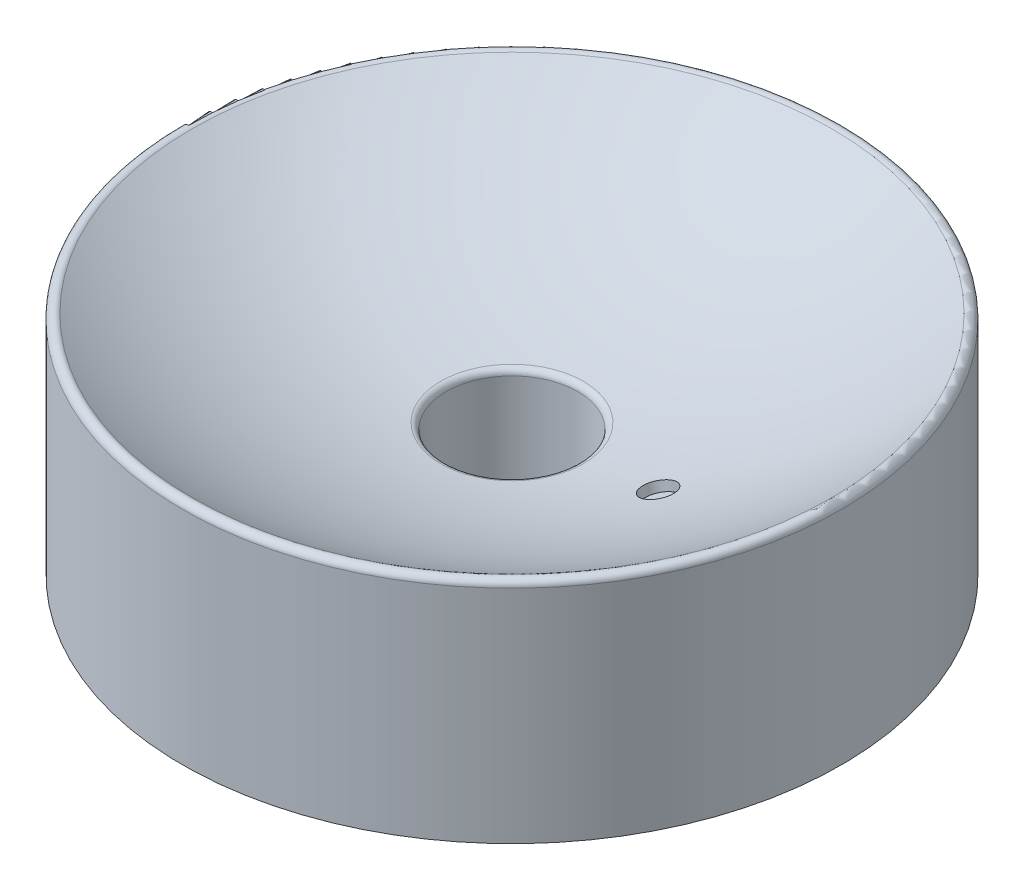
ISO-10303-21;
HEADER;
FILE_DESCRIPTION(('STEP AP214'),'2;1');
FILE_NAME('part.step','',(''),(''),'','','');
FILE_SCHEMA(('AUTOMOTIVE_DESIGN { 1 0 10303 214 1 1 1 1 }'));
ENDSEC;
DATA;
#1=APPLICATION_CONTEXT('core data for automotive mechanical design processes');
#2=APPLICATION_PROTOCOL_DEFINITION('international standard','automotive_design',2000,#1);
#3=PRODUCT_CONTEXT('',#1,'mechanical');
#4=PRODUCT('Part','Part','',(#3));
#5=PRODUCT_RELATED_PRODUCT_CATEGORY('part','',(#4));
#6=PRODUCT_DEFINITION_FORMATION('','',#4);
#7=PRODUCT_DEFINITION_CONTEXT('part definition',#1,'design');
#8=PRODUCT_DEFINITION('design','',#6,#7);
#9=PRODUCT_DEFINITION_SHAPE('','',#8);
#10=(LENGTH_UNIT() NAMED_UNIT(*) SI_UNIT(.MILLI.,.METRE.));
#11=(NAMED_UNIT(*) PLANE_ANGLE_UNIT() SI_UNIT($,.RADIAN.));
#12=(NAMED_UNIT(*) SI_UNIT($,.STERADIAN.) SOLID_ANGLE_UNIT());
#13=UNCERTAINTY_MEASURE_WITH_UNIT(LENGTH_MEASURE(1.E-05),#10,'distance_accuracy_value','');
#14=(GEOMETRIC_REPRESENTATION_CONTEXT(3) GLOBAL_UNCERTAINTY_ASSIGNED_CONTEXT((#13)) GLOBAL_UNIT_ASSIGNED_CONTEXT((#10,
#11,#12)) REPRESENTATION_CONTEXT('',''));
#15=CARTESIAN_POINT('',(0.,0.,0.));
#16=DIRECTION('',(0.,0.,1.));
#17=DIRECTION('',(1.,0.,0.));
#18=AXIS2_PLACEMENT_3D('',#15,#16,#17);
#19=CARTESIAN_POINT('',(21.,0.,0.));
#20=DIRECTION('',(0.,-1.,0.));
#21=DIRECTION('',(0.,0.,-1.));
#22=AXIS2_PLACEMENT_3D('',#19,#20,#21);
#23=PLANE('',#22);
#24=CARTESIAN_POINT('',(0.,0.,0.));
#25=DIRECTION('',(0.,-1.,0.));
#26=DIRECTION('',(0.,0.,-1.));
#27=AXIS2_PLACEMENT_3D('',#24,#25,#26);
#28=CIRCLE('',#27,22.5);
#29=CARTESIAN_POINT('',(0.,0.,-22.5));
#30=VERTEX_POINT('',#29);
#31=EDGE_CURVE('E83',#30,#30,#28,.T.);
#32=ORIENTED_EDGE('',*,*,#31,.T.);
#33=EDGE_LOOP('',(#32));
#34=FACE_BOUND('',#33,.T.);
#35=CARTESIAN_POINT('',(0.,0.,0.));
#36=DIRECTION('',(0.,-1.,0.));
#37=DIRECTION('',(0.,0.,-1.));
#38=AXIS2_PLACEMENT_3D('',#35,#36,#37);
#39=CIRCLE('',#38,21.);
#40=CARTESIAN_POINT('',(0.,0.,-21.));
#41=VERTEX_POINT('',#40);
#42=EDGE_CURVE('E10',#41,#41,#39,.T.);
#43=ORIENTED_EDGE('',*,*,#42,.F.);
#44=EDGE_LOOP('',(#43));
#45=FACE_BOUND('',#44,.T.);
#46=ADVANCED_FACE('F37',(#34,#45),#23,.T.);
#47=CARTESIAN_POINT('',(0.,0.,0.));
#48=DIRECTION('',(0.,-1.,0.));
#49=DIRECTION('',(0.,0.,-1.));
#50=AXIS2_PLACEMENT_3D('',#47,#48,#49);
#51=CYLINDRICAL_SURFACE('',#50,21.);
#52=ORIENTED_EDGE('',*,*,#42,.T.);
#53=EDGE_LOOP('',(#52));
#54=FACE_BOUND('',#53,.T.);
#55=CARTESIAN_POINT('',(0.,40.,0.));
#56=DIRECTION('',(0.,-1.,0.));
#57=DIRECTION('',(0.,0.,-1.));
#58=AXIS2_PLACEMENT_3D('',#55,#56,#57);
#59=CIRCLE('',#58,21.);
#60=CARTESIAN_POINT('',(0.,40.,-21.));
#61=VERTEX_POINT('',#60);
#62=EDGE_CURVE('E44',#61,#61,#59,.T.);
#63=ORIENTED_EDGE('',*,*,#62,.F.);
#64=EDGE_LOOP('',(#63));
#65=FACE_BOUND('',#64,.T.);
#66=ADVANCED_FACE('F170',(#54,#65),#51,.F.);
#67=CARTESIAN_POINT('',(0.,40.,0.));
#68=DIRECTION('',(0.,-1.,0.));
#69=DIRECTION('',(0.,0.,-1.));
#70=AXIS2_PLACEMENT_3D('',#67,#68,#69);
#71=TOROIDAL_SURFACE('',#70,23.,2.00000000000001);
#72=ORIENTED_EDGE('',*,*,#62,.T.);
#73=EDGE_LOOP('',(#72));
#74=FACE_BOUND('',#73,.T.);
#75=CARTESIAN_POINT('',(0.,41.983965429696,0.));
#76=DIRECTION('',(0.,-1.,0.));
#77=DIRECTION('',(0.,0.,-1.));
#78=AXIS2_PLACEMENT_3D('',#75,#76,#77);
#79=CIRCLE('',#78,22.7472527472527);
#80=CARTESIAN_POINT('',(0.,41.983965429696,-22.7472527472527));
#81=VERTEX_POINT('',#80);
#82=EDGE_CURVE('E48',#81,#81,#79,.T.);
#83=ORIENTED_EDGE('',*,*,#82,.F.);
#84=EDGE_LOOP('',(#83));
#85=FACE_BOUND('',#84,.T.);
#86=ADVANCED_FACE('F115',(#74,#85),#71,.T.);
#87=CARTESIAN_POINT('',(0.,220.540854102333,0.));
#88=DIRECTION('',(0.,-1.,0.));
#89=DIRECTION('',(1.,0.,0.));
#90=AXIS2_PLACEMENT_3D('',#87,#88,#89);
#91=SPHERICAL_SURFACE('',#90,180.);
#92=CARTESIAN_POINT('',(46.5694511051966,46.7412964971406,0.));
#93=DIRECTION('',(-0.258819045102515,0.96592582628907,0.));
#94=DIRECTION('',(-0.96592582628907,-0.258819045102515,0.));
#95=AXIS2_PLACEMENT_3D('',#92,#93,#94);
#96=CIRCLE('',#95,4.99999999999999);
#97=CARTESIAN_POINT('',(41.7398219737512,45.447201271628,0.));
#98=VERTEX_POINT('',#97);
#99=EDGE_CURVE('E86',#98,#98,#96,.T.);
#100=ORIENTED_EDGE('',*,*,#99,.F.);
#101=EDGE_LOOP('',(#100));
#102=FACE_BOUND('',#101,.T.);
#103=ORIENTED_EDGE('',*,*,#82,.T.);
#104=EDGE_LOOP('',(#103));
#105=FACE_BOUND('',#104,.T.);
#106=CARTESIAN_POINT('',(0.,72.1397634402465,0.));
#107=DIRECTION('',(0.,-1.,0.));
#108=DIRECTION('',(0.,0.,-1.));
#109=AXIS2_PLACEMENT_3D('',#106,#107,#108);
#110=CIRCLE('',#109,101.868131868132);
#111=CARTESIAN_POINT('',(0.,72.1397634402465,-101.868131868132));
#112=VERTEX_POINT('',#111);
#113=EDGE_CURVE('E54',#112,#112,#110,.T.);
#114=ORIENTED_EDGE('',*,*,#113,.F.);
#115=EDGE_LOOP('',(#114));
#116=FACE_BOUND('',#115,.T.);
#117=ADVANCED_FACE('F111',(#102,#105,#116),#91,.F.);
#118=CARTESIAN_POINT('',(0.,70.4908624328901,0.));
#119=DIRECTION('',(0.,-1.,0.));
#120=DIRECTION('',(0.,0.,-1.));
#121=AXIS2_PLACEMENT_3D('',#118,#119,#120);
#122=TOROIDAL_SURFACE('',#121,103.,1.99999999999999);
#123=ORIENTED_EDGE('',*,*,#113,.T.);
#124=EDGE_LOOP('',(#123));
#125=FACE_BOUND('',#124,.T.);
#126=CARTESIAN_POINT('',(0.,70.4908624328901,0.));
#127=DIRECTION('',(0.,-1.,0.));
#128=DIRECTION('',(0.,0.,-1.));
#129=AXIS2_PLACEMENT_3D('',#126,#127,#128);
#130=CIRCLE('',#129,105.);
#131=CARTESIAN_POINT('',(0.,70.4908624328901,-105.));
#132=VERTEX_POINT('',#131);
#133=EDGE_CURVE('E57',#132,#132,#130,.T.);
#134=ORIENTED_EDGE('',*,*,#133,.F.);
#135=EDGE_LOOP('',(#134));
#136=FACE_BOUND('',#135,.T.);
#137=ADVANCED_FACE('F114',(#125,#136),#122,.T.);
#138=CARTESIAN_POINT('',(0.,0.,0.));
#139=DIRECTION('',(0.,-1.,0.));
#140=DIRECTION('',(0.,0.,-1.));
#141=AXIS2_PLACEMENT_3D('',#138,#139,#140);
#142=CYLINDRICAL_SURFACE('',#141,105.);
#143=ORIENTED_EDGE('',*,*,#133,.T.);
#144=EDGE_LOOP('',(#143));
#145=FACE_BOUND('',#144,.T.);
#146=CARTESIAN_POINT('',(0.,0.,0.));
#147=DIRECTION('',(0.,-1.,0.));
#148=DIRECTION('',(0.,0.,-1.));
#149=AXIS2_PLACEMENT_3D('',#146,#147,#148);
#150=CIRCLE('',#149,105.);
#151=CARTESIAN_POINT('',(0.,0.,-105.));
#152=VERTEX_POINT('',#151);
#153=EDGE_CURVE('E61',#152,#152,#150,.T.);
#154=ORIENTED_EDGE('',*,*,#153,.F.);
#155=EDGE_LOOP('',(#154));
#156=FACE_BOUND('',#155,.T.);
#157=ADVANCED_FACE('F123',(#145,#156),#142,.T.);
#158=CARTESIAN_POINT('',(105.,0.,0.));
#159=DIRECTION('',(0.,-1.,0.));
#160=DIRECTION('',(0.,0.,-1.));
#161=AXIS2_PLACEMENT_3D('',#158,#159,#160);
#162=PLANE('',#161);
#163=ORIENTED_EDGE('',*,*,#153,.T.);
#164=EDGE_LOOP('',(#163));
#165=FACE_BOUND('',#164,.T.);
#166=CARTESIAN_POINT('',(0.,0.,0.));
#167=DIRECTION('',(0.,-1.,0.));
#168=DIRECTION('',(0.,0.,-1.));
#169=AXIS2_PLACEMENT_3D('',#166,#167,#168);
#170=CIRCLE('',#169,103.5);
#171=CARTESIAN_POINT('',(0.,0.,-103.5));
#172=VERTEX_POINT('',#171);
#173=EDGE_CURVE('E65',#172,#172,#170,.T.);
#174=ORIENTED_EDGE('',*,*,#173,.F.);
#175=EDGE_LOOP('',(#174));
#176=FACE_BOUND('',#175,.T.);
#177=ADVANCED_FACE('F129',(#165,#176),#162,.T.);
#178=CARTESIAN_POINT('',(0.,0.,0.));
#179=DIRECTION('',(0.,-1.,0.));
#180=DIRECTION('',(0.,0.,-1.));
#181=AXIS2_PLACEMENT_3D('',#178,#179,#180);
#182=CYLINDRICAL_SURFACE('',#181,103.5);
#183=ORIENTED_EDGE('',*,*,#173,.T.);
#184=EDGE_LOOP('',(#183));
#185=FACE_BOUND('',#184,.T.);
#186=CARTESIAN_POINT('',(0.,59.3740150813982,0.));
#187=DIRECTION('',(0.,-1.,0.));
#188=DIRECTION('',(0.,0.,-1.));
#189=AXIS2_PLACEMENT_3D('',#186,#187,#188);
#190=CIRCLE('',#189,103.5);
#191=CARTESIAN_POINT('',(0.,59.3740150813982,-103.5));
#192=VERTEX_POINT('',#191);
#193=EDGE_CURVE('E69',#192,#192,#190,.T.);
#194=ORIENTED_EDGE('',*,*,#193,.F.);
#195=EDGE_LOOP('',(#194));
#196=FACE_BOUND('',#195,.T.);
#197=ADVANCED_FACE('F135',(#185,#196),#182,.F.);
#198=CARTESIAN_POINT('',(0.,59.3740150813982,0.));
#199=DIRECTION('',(0.,-1.,0.));
#200=DIRECTION('',(0.,0.,-1.));
#201=AXIS2_PLACEMENT_3D('',#198,#199,#200);
#202=TOROIDAL_SURFACE('',#201,102.5,1.00000000000002);
#203=ORIENTED_EDGE('',*,*,#193,.T.);
#204=EDGE_LOOP('',(#203));
#205=FACE_BOUND('',#204,.T.);
#206=CARTESIAN_POINT('',(0.,60.2178205212985,0.));
#207=DIRECTION('',(0.,-1.,0.));
#208=DIRECTION('',(0.,0.,-1.));
#209=AXIS2_PLACEMENT_3D('',#206,#207,#208);
#210=CIRCLE('',#209,101.96335078534);
#211=CARTESIAN_POINT('',(0.,60.2178205212985,-101.96335078534));
#212=VERTEX_POINT('',#211);
#213=EDGE_CURVE('E73',#212,#212,#210,.T.);
#214=ORIENTED_EDGE('',*,*,#213,.F.);
#215=EDGE_LOOP('',(#214));
#216=FACE_BOUND('',#215,.T.);
#217=ADVANCED_FACE('F141',(#205,#216),#202,.F.);
#218=CARTESIAN_POINT('',(0.,220.540854102333,0.));
#219=DIRECTION('',(0.,-1.,0.));
#220=DIRECTION('',(1.,0.,0.));
#221=AXIS2_PLACEMENT_3D('',#218,#219,#220);
#222=SPHERICAL_SURFACE('',#221,190.);
#223=CARTESIAN_POINT('',(49.1740860644102,37.020666494185,0.));
#224=DIRECTION('',(-0.258819045102515,0.96592582628907,0.));
#225=DIRECTION('',(-0.96592582628907,-0.258819045102515,0.));
#226=AXIS2_PLACEMENT_3D('',#223,#224,#225);
#227=CIRCLE('',#226,1.49999999999999);
#228=CARTESIAN_POINT('',(47.7251973249766,36.6324379265312,0.));
#229=VERTEX_POINT('',#228);
#230=EDGE_CURVE('E40',#229,#229,#227,.F.);
#231=ORIENTED_EDGE('',*,*,#230,.F.);
#232=EDGE_LOOP('',(#231));
#233=FACE_BOUND('',#232,.T.);
#234=ORIENTED_EDGE('',*,*,#213,.T.);
#235=EDGE_LOOP('',(#234));
#236=FACE_BOUND('',#235,.T.);
#237=CARTESIAN_POINT('',(0.,31.9844498501944,0.));
#238=DIRECTION('',(0.,-1.,0.));
#239=DIRECTION('',(0.,0.,-1.));
#240=AXIS2_PLACEMENT_3D('',#237,#238,#239);
#241=CIRCLE('',#240,23.3769633507852);
#242=CARTESIAN_POINT('',(0.,31.9844498501944,-23.3769633507852));
#243=VERTEX_POINT('',#242);
#244=EDGE_CURVE('E77',#243,#243,#241,.T.);
#245=ORIENTED_EDGE('',*,*,#244,.F.);
#246=EDGE_LOOP('',(#245));
#247=FACE_BOUND('',#246,.T.);
#248=ADVANCED_FACE('F147',(#233,#236,#247),#222,.T.);
#249=CARTESIAN_POINT('',(0.,30.9920477225515,0.));
#250=DIRECTION('',(0.,-1.,0.));
#251=DIRECTION('',(0.,0.,-1.));
#252=AXIS2_PLACEMENT_3D('',#249,#250,#251);
#253=TOROIDAL_SURFACE('',#252,23.5,1.);
#254=ORIENTED_EDGE('',*,*,#244,.T.);
#255=EDGE_LOOP('',(#254));
#256=FACE_BOUND('',#255,.T.);
#257=CARTESIAN_POINT('',(0.,30.9920477225515,0.));
#258=DIRECTION('',(0.,-1.,0.));
#259=DIRECTION('',(0.,0.,-1.));
#260=AXIS2_PLACEMENT_3D('',#257,#258,#259);
#261=CIRCLE('',#260,22.5);
#262=CARTESIAN_POINT('',(0.,30.9920477225515,-22.5));
#263=VERTEX_POINT('',#262);
#264=EDGE_CURVE('E80',#263,#263,#261,.T.);
#265=ORIENTED_EDGE('',*,*,#264,.F.);
#266=EDGE_LOOP('',(#265));
#267=FACE_BOUND('',#266,.T.);
#268=ADVANCED_FACE('F153',(#256,#267),#253,.F.);
#269=CARTESIAN_POINT('',(0.,0.,0.));
#270=DIRECTION('',(0.,-1.,0.));
#271=DIRECTION('',(0.,0.,-1.));
#272=AXIS2_PLACEMENT_3D('',#269,#270,#271);
#273=CYLINDRICAL_SURFACE('',#272,22.5);
#274=ORIENTED_EDGE('',*,*,#264,.T.);
#275=EDGE_LOOP('',(#274));
#276=FACE_BOUND('',#275,.T.);
#277=ORIENTED_EDGE('',*,*,#31,.F.);
#278=EDGE_LOOP('',(#277));
#279=FACE_BOUND('',#278,.T.);
#280=ADVANCED_FACE('F107',(#276,#279),#273,.T.);
#281=CARTESIAN_POINT('',(0.,220.540854102333,0.));
#282=DIRECTION('',(-0.258819045102515,0.96592582628907,0.));
#283=DIRECTION('',(-0.96592582628907,-0.258819045102515,0.));
#284=AXIS2_PLACEMENT_3D('',#281,#282,#283);
#285=CYLINDRICAL_SURFACE('',#284,4.99999999999998);
#286=CARTESIAN_POINT('',(47.3459082405041,43.8435190182734,0.));
#287=DIRECTION('',(-0.258819045102515,0.96592582628907,0.));
#288=DIRECTION('',(-0.96592582628907,-0.258819045102515,0.));
#289=AXIS2_PLACEMENT_3D('',#286,#287,#288);
#290=CIRCLE('',#289,4.99999999999999);
#291=CARTESIAN_POINT('',(42.5162791090588,42.5494237927608,0.));
#292=VERTEX_POINT('',#291);
#293=EDGE_CURVE('E89',#292,#292,#290,.T.);
#294=ORIENTED_EDGE('',*,*,#293,.F.);
#295=EDGE_LOOP('',(#294));
#296=FACE_BOUND('',#295,.T.);
#297=ORIENTED_EDGE('',*,*,#99,.T.);
#298=EDGE_LOOP('',(#297));
#299=FACE_BOUND('',#298,.T.);
#300=ADVANCED_FACE('F101',(#296,#299),#285,.F.);
#301=CARTESIAN_POINT('',(42.5162791090588,42.5494237927608,0.));
#302=DIRECTION('',(0.258819045102515,-0.96592582628907,0.));
#303=DIRECTION('',(0.96592582628907,0.258819045102515,0.));
#304=AXIS2_PLACEMENT_3D('',#301,#302,#303);
#305=PLANE('',#304);
#306=CARTESIAN_POINT('',(47.3459082405041,43.8435190182734,0.));
#307=DIRECTION('',(-0.258819045102515,0.96592582628907,0.));
#308=DIRECTION('',(-0.96592582628907,-0.258819045102515,0.));
#309=AXIS2_PLACEMENT_3D('',#306,#307,#308);
#310=CIRCLE('',#309,1.5);
#311=CARTESIAN_POINT('',(45.8970195010705,43.4552904506196,0.));
#312=VERTEX_POINT('',#311);
#313=EDGE_CURVE('E92',#312,#312,#310,.T.);
#314=ORIENTED_EDGE('',*,*,#313,.F.);
#315=EDGE_LOOP('',(#314));
#316=FACE_BOUND('',#315,.T.);
#317=ORIENTED_EDGE('',*,*,#293,.T.);
#318=EDGE_LOOP('',(#317));
#319=FACE_BOUND('',#318,.T.);
#320=ADVANCED_FACE('F98',(#316,#319),#305,.F.);
#321=CARTESIAN_POINT('',(0.,220.540854102333,0.));
#322=DIRECTION('',(-0.258819045102515,0.96592582628907,0.));
#323=DIRECTION('',(-0.96592582628907,-0.258819045102515,0.));
#324=AXIS2_PLACEMENT_3D('',#321,#322,#323);
#325=CYLINDRICAL_SURFACE('',#324,1.49999999999999);
#326=ORIENTED_EDGE('',*,*,#230,.T.);
#327=EDGE_LOOP('',(#326));
#328=FACE_BOUND('',#327,.T.);
#329=ORIENTED_EDGE('',*,*,#313,.T.);
#330=EDGE_LOOP('',(#329));
#331=FACE_BOUND('',#330,.T.);
#332=ADVANCED_FACE('F96',(#328,#331),#325,.F.);
#333=CLOSED_SHELL('',(#46,#66,#86,#117,#137,#157,#177,#197,#217,#248,#268,#280,#300,#320,#332));
#334=MANIFOLD_SOLID_BREP('B2',#333);
#335=ADVANCED_BREP_SHAPE_REPRESENTATION('',(#18,#334),#14);
#336=SHAPE_DEFINITION_REPRESENTATION(#9,#335);
ENDSEC;
END-ISO-10303-21;
